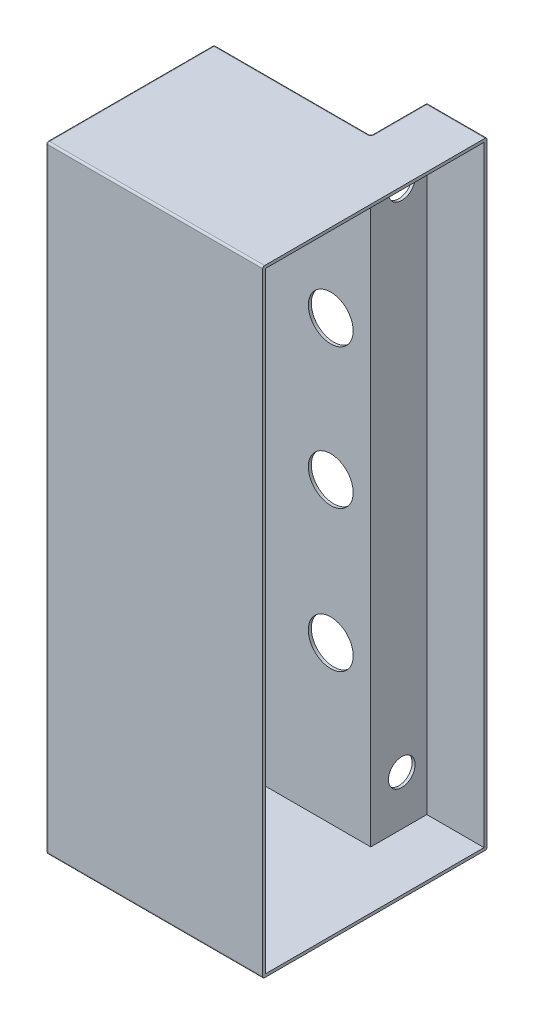
ISO-10303-21;
HEADER;
FILE_DESCRIPTION(('STEP AP214'),'2;1');
FILE_NAME('part.step','',(''),(''),'','','');
FILE_SCHEMA(('AUTOMOTIVE_DESIGN { 1 0 10303 214 1 1 1 1 }'));
ENDSEC;
DATA;
#1=APPLICATION_CONTEXT('core data for automotive mechanical design processes');
#2=APPLICATION_PROTOCOL_DEFINITION('international standard','automotive_design',2000,#1);
#3=PRODUCT_CONTEXT('',#1,'mechanical');
#4=PRODUCT('Part','Part','',(#3));
#5=PRODUCT_RELATED_PRODUCT_CATEGORY('part','',(#4));
#6=PRODUCT_DEFINITION_FORMATION('','',#4);
#7=PRODUCT_DEFINITION_CONTEXT('part definition',#1,'design');
#8=PRODUCT_DEFINITION('design','',#6,#7);
#9=PRODUCT_DEFINITION_SHAPE('','',#8);
#10=(LENGTH_UNIT() NAMED_UNIT(*) SI_UNIT(.MILLI.,.METRE.));
#11=(NAMED_UNIT(*) PLANE_ANGLE_UNIT() SI_UNIT($,.RADIAN.));
#12=(NAMED_UNIT(*) SI_UNIT($,.STERADIAN.) SOLID_ANGLE_UNIT());
#13=UNCERTAINTY_MEASURE_WITH_UNIT(LENGTH_MEASURE(1.E-05),#10,'distance_accuracy_value','');
#14=(GEOMETRIC_REPRESENTATION_CONTEXT(3) GLOBAL_UNCERTAINTY_ASSIGNED_CONTEXT((#13)) GLOBAL_UNIT_ASSIGNED_CONTEXT((#10,
#11,#12)) REPRESENTATION_CONTEXT('',''));
#15=CARTESIAN_POINT('',(0.,0.,0.));
#16=DIRECTION('',(0.,0.,1.));
#17=DIRECTION('',(1.,0.,0.));
#18=AXIS2_PLACEMENT_3D('',#15,#16,#17);
#19=CARTESIAN_POINT('',(3.,165.,-5.));
#20=DIRECTION('',(-1.,0.,0.));
#21=DIRECTION('',(0.,0.,1.));
#22=AXIS2_PLACEMENT_3D('',#19,#20,#21);
#23=PLANE('',#22);
#24=DIRECTION('',(0.,0.,-1.));
#25=VECTOR('',#24,1.);
#26=CARTESIAN_POINT('',(3.,0.,-5.));
#27=LINE('',#26,#25);
#28=CARTESIAN_POINT('',(3.,0.,54.5));
#29=VERTEX_POINT('',#28);
#30=CARTESIAN_POINT('',(3.,0.,-4.5));
#31=VERTEX_POINT('',#30);
#32=EDGE_CURVE('E250',#29,#31,#27,.T.);
#33=ORIENTED_EDGE('',*,*,#32,.T.);
#34=CARTESIAN_POINT('',(3.,0.5,-4.5));
#35=DIRECTION('',(-1.,0.,0.));
#36=DIRECTION('',(0.,0.,1.));
#37=AXIS2_PLACEMENT_3D('',#34,#35,#36);
#38=CIRCLE('',#37,0.5);
#39=CARTESIAN_POINT('',(3.,0.5,-5.));
#40=VERTEX_POINT('',#39);
#41=EDGE_CURVE('E294',#31,#40,#38,.F.);
#42=ORIENTED_EDGE('',*,*,#41,.T.);
#43=DIRECTION('',(0.,-1.,0.));
#44=VECTOR('',#43,1.);
#45=CARTESIAN_POINT('',(3.,165.,-5.));
#46=LINE('',#45,#44);
#47=CARTESIAN_POINT('',(3.,164.5,-5.));
#48=VERTEX_POINT('',#47);
#49=EDGE_CURVE('E249',#48,#40,#46,.T.);
#50=ORIENTED_EDGE('',*,*,#49,.F.);
#51=CARTESIAN_POINT('',(3.,164.5,-4.5));
#52=DIRECTION('',(-1.,0.,0.));
#53=DIRECTION('',(0.,0.,1.));
#54=AXIS2_PLACEMENT_3D('',#51,#52,#53);
#55=CIRCLE('',#54,0.5);
#56=CARTESIAN_POINT('',(3.,165.,-4.5));
#57=VERTEX_POINT('',#56);
#58=EDGE_CURVE('E290',#48,#57,#55,.F.);
#59=ORIENTED_EDGE('',*,*,#58,.T.);
#60=DIRECTION('',(0.,0.,-1.));
#61=VECTOR('',#60,1.);
#62=CARTESIAN_POINT('',(3.,165.,-5.));
#63=LINE('',#62,#61);
#64=CARTESIAN_POINT('',(3.,165.,54.5));
#65=VERTEX_POINT('',#64);
#66=EDGE_CURVE('E247',#65,#57,#63,.T.);
#67=ORIENTED_EDGE('',*,*,#66,.F.);
#68=CARTESIAN_POINT('',(3.,164.5,54.5));
#69=DIRECTION('',(-1.,0.,0.));
#70=DIRECTION('',(0.,0.,1.));
#71=AXIS2_PLACEMENT_3D('',#68,#69,#70);
#72=CIRCLE('',#71,0.5);
#73=CARTESIAN_POINT('',(3.,164.5,55.));
#74=VERTEX_POINT('',#73);
#75=EDGE_CURVE('E288',#65,#74,#72,.F.);
#76=ORIENTED_EDGE('',*,*,#75,.T.);
#77=DIRECTION('',(0.,-1.,0.));
#78=VECTOR('',#77,1.);
#79=CARTESIAN_POINT('',(3.,165.,55.));
#80=LINE('',#79,#78);
#81=CARTESIAN_POINT('',(3.,0.5,55.));
#82=VERTEX_POINT('',#81);
#83=EDGE_CURVE('E255',#74,#82,#80,.T.);
#84=ORIENTED_EDGE('',*,*,#83,.T.);
#85=CARTESIAN_POINT('',(3.,0.5,54.5));
#86=DIRECTION('',(-1.,0.,0.));
#87=DIRECTION('',(0.,0.,1.));
#88=AXIS2_PLACEMENT_3D('',#85,#86,#87);
#89=CIRCLE('',#88,0.5);
#90=EDGE_CURVE('E292',#82,#29,#89,.F.);
#91=ORIENTED_EDGE('',*,*,#90,.T.);
#92=EDGE_LOOP('',(#33,#42,#50,#59,#67,#76,#84,#91));
#93=FACE_BOUND('',#92,.T.);
#94=DIRECTION('',(0.,0.,-1.));
#95=VECTOR('',#94,1.);
#96=CARTESIAN_POINT('',(3.,0.8,0.));
#97=LINE('',#96,#95);
#98=CARTESIAN_POINT('',(3.,0.8,54.2));
#99=VERTEX_POINT('',#98);
#100=CARTESIAN_POINT('',(3.,0.8,-4.2));
#101=VERTEX_POINT('',#100);
#102=EDGE_CURVE('E234',#99,#101,#97,.T.);
#103=ORIENTED_EDGE('',*,*,#102,.F.);
#104=DIRECTION('',(0.,-1.,0.));
#105=VECTOR('',#104,1.);
#106=CARTESIAN_POINT('',(3.,165.,54.2));
#107=LINE('',#106,#105);
#108=CARTESIAN_POINT('',(3.,164.2,54.2));
#109=VERTEX_POINT('',#108);
#110=EDGE_CURVE('E230',#109,#99,#107,.T.);
#111=ORIENTED_EDGE('',*,*,#110,.F.);
#112=DIRECTION('',(0.,0.,-1.));
#113=VECTOR('',#112,1.);
#114=CARTESIAN_POINT('',(3.,164.2,0.));
#115=LINE('',#114,#113);
#116=CARTESIAN_POINT('',(3.,164.2,-4.2));
#117=VERTEX_POINT('',#116);
#118=EDGE_CURVE('E237',#109,#117,#115,.T.);
#119=ORIENTED_EDGE('',*,*,#118,.T.);
#120=DIRECTION('',(0.,-1.,0.));
#121=VECTOR('',#120,1.);
#122=CARTESIAN_POINT('',(3.,165.,-4.2));
#123=LINE('',#122,#121);
#124=EDGE_CURVE('E238',#117,#101,#123,.T.);
#125=ORIENTED_EDGE('',*,*,#124,.T.);
#126=EDGE_LOOP('',(#103,#111,#119,#125));
#127=FACE_BOUND('',#126,.T.);
#128=ADVANCED_FACE('F41',(#93,#127),#23,.F.);
#129=CARTESIAN_POINT('',(-13.1,165.,-5.));
#130=DIRECTION('',(0.,0.,1.));
#131=DIRECTION('',(1.,0.,0.));
#132=AXIS2_PLACEMENT_3D('',#129,#130,#131);
#133=PLANE('',#132);
#134=ORIENTED_EDGE('',*,*,#49,.T.);
#135=DIRECTION('',(-1.,0.,0.));
#136=VECTOR('',#135,1.);
#137=CARTESIAN_POINT('',(-13.1,0.5,-5.));
#138=LINE('',#137,#136);
#139=CARTESIAN_POINT('',(-12.6,0.5,-5.));
#140=VERTEX_POINT('',#139);
#141=EDGE_CURVE('E272',#40,#140,#138,.T.);
#142=ORIENTED_EDGE('',*,*,#141,.T.);
#143=DIRECTION('',(0.,-1.,0.));
#144=VECTOR('',#143,1.);
#145=CARTESIAN_POINT('',(-12.6,165.,-5.));
#146=LINE('',#145,#144);
#147=CARTESIAN_POINT('',(-12.6,164.5,-5.));
#148=VERTEX_POINT('',#147);
#149=EDGE_CURVE('E270',#140,#148,#146,.F.);
#150=ORIENTED_EDGE('',*,*,#149,.T.);
#151=DIRECTION('',(-1.,0.,0.));
#152=VECTOR('',#151,1.);
#153=CARTESIAN_POINT('',(-13.1,164.5,-5.));
#154=LINE('',#153,#152);
#155=EDGE_CURVE('E258',#148,#48,#154,.F.);
#156=ORIENTED_EDGE('',*,*,#155,.T.);
#157=EDGE_LOOP('',(#134,#142,#150,#156));
#158=FACE_BOUND('',#157,.T.);
#159=ADVANCED_FACE('F455',(#158),#133,.F.);
#160=CARTESIAN_POINT('',(-13.1,165.,10.));
#161=DIRECTION('',(1.,0.,0.));
#162=DIRECTION('',(0.,0.,-1.));
#163=AXIS2_PLACEMENT_3D('',#160,#161,#162);
#164=PLANE('',#163);
#165=CARTESIAN_POINT('',(-13.1,150.,2.5));
#166=DIRECTION('',(-1.,0.,0.));
#167=DIRECTION('',(0.,0.,1.));
#168=AXIS2_PLACEMENT_3D('',#165,#166,#167);
#169=CIRCLE('',#168,3.57187499999997);
#170=CARTESIAN_POINT('',(-13.1,150.,6.07187499999997));
#171=VERTEX_POINT('',#170);
#172=EDGE_CURVE('E416',#171,#171,#169,.T.);
#173=ORIENTED_EDGE('',*,*,#172,.F.);
#174=EDGE_LOOP('',(#173));
#175=FACE_BOUND('',#174,.T.);
#176=CARTESIAN_POINT('',(-13.1,14.,2.5));
#177=DIRECTION('',(-1.,0.,0.));
#178=DIRECTION('',(0.,0.,1.));
#179=AXIS2_PLACEMENT_3D('',#176,#177,#178);
#180=CIRCLE('',#179,3.57187499999999);
#181=CARTESIAN_POINT('',(-13.1,14.,6.07187499999999));
#182=VERTEX_POINT('',#181);
#183=EDGE_CURVE('E408',#182,#182,#180,.T.);
#184=ORIENTED_EDGE('',*,*,#183,.F.);
#185=EDGE_LOOP('',(#184));
#186=FACE_BOUND('',#185,.T.);
#187=DIRECTION('',(0.,-1.,0.));
#188=VECTOR('',#187,1.);
#189=CARTESIAN_POINT('',(-13.1,165.,-4.5));
#190=LINE('',#189,#188);
#191=CARTESIAN_POINT('',(-13.1,164.5,-4.5));
#192=VERTEX_POINT('',#191);
#193=CARTESIAN_POINT('',(-13.1,0.5,-4.5));
#194=VERTEX_POINT('',#193);
#195=EDGE_CURVE('E298',#192,#194,#190,.T.);
#196=ORIENTED_EDGE('',*,*,#195,.T.);
#197=DIRECTION('',(0.,0.,1.));
#198=VECTOR('',#197,1.);
#199=CARTESIAN_POINT('',(-13.1,0.5,10.));
#200=LINE('',#199,#198);
#201=CARTESIAN_POINT('',(-13.1,0.5,9.5));
#202=VERTEX_POINT('',#201);
#203=EDGE_CURVE('E302',#194,#202,#200,.T.);
#204=ORIENTED_EDGE('',*,*,#203,.T.);
#205=DIRECTION('',(0.,-1.,0.));
#206=VECTOR('',#205,1.);
#207=CARTESIAN_POINT('',(-13.1,165.,9.5));
#208=LINE('',#207,#206);
#209=CARTESIAN_POINT('',(-13.1,164.5,9.5));
#210=VERTEX_POINT('',#209);
#211=EDGE_CURVE('E300',#202,#210,#208,.F.);
#212=ORIENTED_EDGE('',*,*,#211,.T.);
#213=DIRECTION('',(0.,0.,1.));
#214=VECTOR('',#213,1.);
#215=CARTESIAN_POINT('',(-13.1,164.5,10.));
#216=LINE('',#215,#214);
#217=EDGE_CURVE('E296',#210,#192,#216,.F.);
#218=ORIENTED_EDGE('',*,*,#217,.T.);
#219=EDGE_LOOP('',(#196,#204,#212,#218));
#220=FACE_BOUND('',#219,.T.);
#221=ADVANCED_FACE('F461',(#175,#186,#220),#164,.F.);
#222=CARTESIAN_POINT('',(-55.,165.,10.));
#223=DIRECTION('',(0.,0.,1.));
#224=DIRECTION('',(1.,0.,0.));
#225=AXIS2_PLACEMENT_3D('',#222,#223,#224);
#226=PLANE('',#225);
#227=DIRECTION('',(-1.,0.,0.));
#228=VECTOR('',#227,1.);
#229=CARTESIAN_POINT('',(-55.,164.5,10.));
#230=LINE('',#229,#228);
#231=CARTESIAN_POINT('',(-54.5,164.5,10.));
#232=VERTEX_POINT('',#231);
#233=CARTESIAN_POINT('',(-13.6,164.5,10.));
#234=VERTEX_POINT('',#233);
#235=EDGE_CURVE('E305',#232,#234,#230,.F.);
#236=ORIENTED_EDGE('',*,*,#235,.T.);
#237=DIRECTION('',(0.,-1.,0.));
#238=VECTOR('',#237,1.);
#239=CARTESIAN_POINT('',(-13.6,0.,10.));
#240=LINE('',#239,#238);
#241=CARTESIAN_POINT('',(-13.6,0.5,10.));
#242=VERTEX_POINT('',#241);
#243=EDGE_CURVE('E311',#234,#242,#240,.T.);
#244=ORIENTED_EDGE('',*,*,#243,.T.);
#245=DIRECTION('',(-1.,0.,0.));
#246=VECTOR('',#245,1.);
#247=CARTESIAN_POINT('',(-55.,0.5,10.));
#248=LINE('',#247,#246);
#249=CARTESIAN_POINT('',(-54.5,0.5,10.));
#250=VERTEX_POINT('',#249);
#251=EDGE_CURVE('E309',#242,#250,#248,.T.);
#252=ORIENTED_EDGE('',*,*,#251,.T.);
#253=DIRECTION('',(0.,-1.,0.));
#254=VECTOR('',#253,1.);
#255=CARTESIAN_POINT('',(-54.5,165.,10.));
#256=LINE('',#255,#254);
#257=EDGE_CURVE('E307',#250,#232,#256,.F.);
#258=ORIENTED_EDGE('',*,*,#257,.T.);
#259=EDGE_LOOP('',(#236,#244,#252,#258));
#260=FACE_BOUND('',#259,.T.);
#261=CARTESIAN_POINT('',(-23.,42.75,10.));
#262=DIRECTION('',(0.,0.,-1.));
#263=DIRECTION('',(-1.,0.,0.));
#264=AXIS2_PLACEMENT_3D('',#261,#262,#263);
#265=CIRCLE('',#264,6.);
#266=CARTESIAN_POINT('',(-29.,42.75,10.));
#267=VERTEX_POINT('',#266);
#268=EDGE_CURVE('E263',#267,#267,#265,.T.);
#269=ORIENTED_EDGE('',*,*,#268,.F.);
#270=EDGE_LOOP('',(#269));
#271=FACE_BOUND('',#270,.T.);
#272=CARTESIAN_POINT('',(-23.,80.55,10.));
#273=DIRECTION('',(0.,0.,-1.));
#274=DIRECTION('',(-1.,0.,0.));
#275=AXIS2_PLACEMENT_3D('',#272,#273,#274);
#276=CIRCLE('',#275,6.);
#277=CARTESIAN_POINT('',(-29.,80.55,10.));
#278=VERTEX_POINT('',#277);
#279=EDGE_CURVE('E421',#278,#278,#276,.T.);
#280=ORIENTED_EDGE('',*,*,#279,.F.);
#281=EDGE_LOOP('',(#280));
#282=FACE_BOUND('',#281,.T.);
#283=CARTESIAN_POINT('',(-23.,118.,10.));
#284=DIRECTION('',(0.,0.,-1.));
#285=DIRECTION('',(-1.,0.,0.));
#286=AXIS2_PLACEMENT_3D('',#283,#284,#285);
#287=CIRCLE('',#286,6.);
#288=CARTESIAN_POINT('',(-29.,118.,10.));
#289=VERTEX_POINT('',#288);
#290=EDGE_CURVE('E406',#289,#289,#287,.T.);
#291=ORIENTED_EDGE('',*,*,#290,.F.);
#292=EDGE_LOOP('',(#291));
#293=FACE_BOUND('',#292,.T.);
#294=ADVANCED_FACE('F476',(#260,#271,#282,#293),#226,.F.);
#295=CARTESIAN_POINT('',(-55.,165.,55.));
#296=DIRECTION('',(1.,0.,0.));
#297=DIRECTION('',(0.,0.,-1.));
#298=AXIS2_PLACEMENT_3D('',#295,#296,#297);
#299=PLANE('',#298);
#300=DIRECTION('',(0.,-1.,0.));
#301=VECTOR('',#300,1.);
#302=CARTESIAN_POINT('',(-55.,165.,10.5));
#303=LINE('',#302,#301);
#304=CARTESIAN_POINT('',(-55.,164.5,10.5));
#305=VERTEX_POINT('',#304);
#306=CARTESIAN_POINT('',(-55.,0.5,10.5));
#307=VERTEX_POINT('',#306);
#308=EDGE_CURVE('E324',#305,#307,#303,.T.);
#309=ORIENTED_EDGE('',*,*,#308,.T.);
#310=DIRECTION('',(0.,0.,1.));
#311=VECTOR('',#310,1.);
#312=CARTESIAN_POINT('',(-55.,0.5,55.));
#313=LINE('',#312,#311);
#314=CARTESIAN_POINT('',(-55.,0.5,54.5));
#315=VERTEX_POINT('',#314);
#316=EDGE_CURVE('E326',#307,#315,#313,.T.);
#317=ORIENTED_EDGE('',*,*,#316,.T.);
#318=DIRECTION('',(0.,-1.,0.));
#319=VECTOR('',#318,1.);
#320=CARTESIAN_POINT('',(-55.,165.,54.5));
#321=LINE('',#320,#319);
#322=CARTESIAN_POINT('',(-55.,164.5,54.5));
#323=VERTEX_POINT('',#322);
#324=EDGE_CURVE('E320',#315,#323,#321,.F.);
#325=ORIENTED_EDGE('',*,*,#324,.T.);
#326=DIRECTION('',(0.,0.,1.));
#327=VECTOR('',#326,1.);
#328=CARTESIAN_POINT('',(-55.,164.5,55.));
#329=LINE('',#328,#327);
#330=EDGE_CURVE('E322',#323,#305,#329,.F.);
#331=ORIENTED_EDGE('',*,*,#330,.T.);
#332=EDGE_LOOP('',(#309,#317,#325,#331));
#333=FACE_BOUND('',#332,.T.);
#334=ADVANCED_FACE('F472',(#333),#299,.F.);
#335=CARTESIAN_POINT('',(3.,165.,55.));
#336=DIRECTION('',(0.,0.,-1.));
#337=DIRECTION('',(-1.,0.,0.));
#338=AXIS2_PLACEMENT_3D('',#335,#336,#337);
#339=PLANE('',#338);
#340=DIRECTION('',(0.,-1.,0.));
#341=VECTOR('',#340,1.);
#342=CARTESIAN_POINT('',(-54.5,165.,55.));
#343=LINE('',#342,#341);
#344=CARTESIAN_POINT('',(-54.5,164.5,55.));
#345=VERTEX_POINT('',#344);
#346=CARTESIAN_POINT('',(-54.5,0.5,55.));
#347=VERTEX_POINT('',#346);
#348=EDGE_CURVE('E314',#345,#347,#343,.T.);
#349=ORIENTED_EDGE('',*,*,#348,.T.);
#350=DIRECTION('',(1.,0.,0.));
#351=VECTOR('',#350,1.);
#352=CARTESIAN_POINT('',(3.,0.5,55.));
#353=LINE('',#352,#351);
#354=EDGE_CURVE('E318',#347,#82,#353,.T.);
#355=ORIENTED_EDGE('',*,*,#354,.T.);
#356=ORIENTED_EDGE('',*,*,#83,.F.);
#357=DIRECTION('',(1.,0.,0.));
#358=VECTOR('',#357,1.);
#359=CARTESIAN_POINT('',(3.,164.5,55.));
#360=LINE('',#359,#358);
#361=EDGE_CURVE('E316',#74,#345,#360,.F.);
#362=ORIENTED_EDGE('',*,*,#361,.T.);
#363=EDGE_LOOP('',(#349,#355,#356,#362));
#364=FACE_BOUND('',#363,.T.);
#365=ADVANCED_FACE('F468',(#364),#339,.F.);
#366=CARTESIAN_POINT('',(0.,165.,0.));
#367=DIRECTION('',(0.,-1.,0.));
#368=DIRECTION('',(0.,0.,-1.));
#369=AXIS2_PLACEMENT_3D('',#366,#367,#368);
#370=PLANE('',#369);
#371=ORIENTED_EDGE('',*,*,#66,.T.);
#372=DIRECTION('',(-1.,0.,0.));
#373=VECTOR('',#372,1.);
#374=CARTESIAN_POINT('',(0.,165.,-4.5));
#375=LINE('',#374,#373);
#376=CARTESIAN_POINT('',(-12.6,165.,-4.5));
#377=VERTEX_POINT('',#376);
#378=EDGE_CURVE('E11',#57,#377,#375,.T.);
#379=ORIENTED_EDGE('',*,*,#378,.T.);
#380=DIRECTION('',(0.,0.,1.));
#381=VECTOR('',#380,1.);
#382=CARTESIAN_POINT('',(-12.6,165.,0.));
#383=LINE('',#382,#381);
#384=CARTESIAN_POINT('',(-12.6,165.,9.5));
#385=VERTEX_POINT('',#384);
#386=EDGE_CURVE('E50',#377,#385,#383,.T.);
#387=ORIENTED_EDGE('',*,*,#386,.T.);
#388=CARTESIAN_POINT('',(-13.6,165.,9.5));
#389=DIRECTION('',(0.,-1.,0.));
#390=DIRECTION('',(0.,0.,-1.));
#391=AXIS2_PLACEMENT_3D('',#388,#389,#390);
#392=CIRCLE('',#391,1.);
#393=CARTESIAN_POINT('',(-13.6,165.,10.5));
#394=VERTEX_POINT('',#393);
#395=EDGE_CURVE('E335',#394,#385,#392,.F.);
#396=ORIENTED_EDGE('',*,*,#395,.F.);
#397=DIRECTION('',(-1.,0.,0.));
#398=VECTOR('',#397,1.);
#399=CARTESIAN_POINT('',(0.,165.,10.5));
#400=LINE('',#399,#398);
#401=CARTESIAN_POINT('',(-54.5,165.,10.5));
#402=VERTEX_POINT('',#401);
#403=EDGE_CURVE('E333',#394,#402,#400,.T.);
#404=ORIENTED_EDGE('',*,*,#403,.T.);
#405=DIRECTION('',(0.,0.,1.));
#406=VECTOR('',#405,1.);
#407=CARTESIAN_POINT('',(-54.5,165.,0.));
#408=LINE('',#407,#406);
#409=CARTESIAN_POINT('',(-54.5,165.,54.5));
#410=VERTEX_POINT('',#409);
#411=EDGE_CURVE('E331',#402,#410,#408,.T.);
#412=ORIENTED_EDGE('',*,*,#411,.T.);
#413=DIRECTION('',(1.,0.,0.));
#414=VECTOR('',#413,1.);
#415=CARTESIAN_POINT('',(0.,165.,54.5));
#416=LINE('',#415,#414);
#417=EDGE_CURVE('E329',#410,#65,#416,.T.);
#418=ORIENTED_EDGE('',*,*,#417,.T.);
#419=EDGE_LOOP('',(#371,#379,#387,#396,#404,#412,#418));
#420=FACE_BOUND('',#419,.T.);
#421=ADVANCED_FACE('F471',(#420),#370,.F.);
#422=CARTESIAN_POINT('',(0.,0.,0.));
#423=DIRECTION('',(0.,-1.,0.));
#424=DIRECTION('',(0.,0.,-1.));
#425=AXIS2_PLACEMENT_3D('',#422,#423,#424);
#426=PLANE('',#425);
#427=DIRECTION('',(0.,0.,1.));
#428=VECTOR('',#427,1.);
#429=CARTESIAN_POINT('',(-12.6,0.,-5.));
#430=LINE('',#429,#428);
#431=CARTESIAN_POINT('',(-12.6,0.,9.5));
#432=VERTEX_POINT('',#431);
#433=CARTESIAN_POINT('',(-12.6,0.,-4.5));
#434=VERTEX_POINT('',#433);
#435=EDGE_CURVE('E284',#432,#434,#430,.F.);
#436=ORIENTED_EDGE('',*,*,#435,.T.);
#437=DIRECTION('',(-1.,0.,0.));
#438=VECTOR('',#437,1.);
#439=CARTESIAN_POINT('',(3.,0.,-4.5));
#440=LINE('',#439,#438);
#441=EDGE_CURVE('E286',#434,#31,#440,.F.);
#442=ORIENTED_EDGE('',*,*,#441,.T.);
#443=ORIENTED_EDGE('',*,*,#32,.F.);
#444=DIRECTION('',(1.,0.,0.));
#445=VECTOR('',#444,1.);
#446=CARTESIAN_POINT('',(-55.,0.,54.5));
#447=LINE('',#446,#445);
#448=CARTESIAN_POINT('',(-54.5,0.,54.5));
#449=VERTEX_POINT('',#448);
#450=EDGE_CURVE('E279',#29,#449,#447,.F.);
#451=ORIENTED_EDGE('',*,*,#450,.T.);
#452=DIRECTION('',(0.,0.,1.));
#453=VECTOR('',#452,1.);
#454=CARTESIAN_POINT('',(-54.5,0.,10.));
#455=LINE('',#454,#453);
#456=CARTESIAN_POINT('',(-54.5,0.,10.5));
#457=VERTEX_POINT('',#456);
#458=EDGE_CURVE('E275',#449,#457,#455,.F.);
#459=ORIENTED_EDGE('',*,*,#458,.T.);
#460=DIRECTION('',(-1.,0.,0.));
#461=VECTOR('',#460,1.);
#462=CARTESIAN_POINT('',(-13.1,0.,10.5));
#463=LINE('',#462,#461);
#464=CARTESIAN_POINT('',(-13.6,0.,10.5));
#465=VERTEX_POINT('',#464);
#466=EDGE_CURVE('E277',#457,#465,#463,.F.);
#467=ORIENTED_EDGE('',*,*,#466,.T.);
#468=CARTESIAN_POINT('',(-13.6,0.,9.5));
#469=DIRECTION('',(0.,-1.,0.));
#470=DIRECTION('',(0.,0.,-1.));
#471=AXIS2_PLACEMENT_3D('',#468,#469,#470);
#472=CIRCLE('',#471,1.);
#473=EDGE_CURVE('E281',#432,#465,#472,.T.);
#474=ORIENTED_EDGE('',*,*,#473,.F.);
#475=EDGE_LOOP('',(#436,#442,#443,#451,#459,#467,#474));
#476=FACE_BOUND('',#475,.T.);
#477=ADVANCED_FACE('F466',(#476),#426,.T.);
#478=CARTESIAN_POINT('',(-13.1,165.,-4.2));
#479=DIRECTION('',(0.,0.,1.));
#480=DIRECTION('',(1.,0.,0.));
#481=AXIS2_PLACEMENT_3D('',#478,#479,#480);
#482=PLANE('',#481);
#483=DIRECTION('',(-1.,0.,0.));
#484=VECTOR('',#483,1.);
#485=CARTESIAN_POINT('',(0.,0.8,-4.2));
#486=LINE('',#485,#484);
#487=CARTESIAN_POINT('',(-12.3,0.8,-4.2));
#488=VERTEX_POINT('',#487);
#489=EDGE_CURVE('E200',#101,#488,#486,.T.);
#490=ORIENTED_EDGE('',*,*,#489,.F.);
#491=ORIENTED_EDGE('',*,*,#124,.F.);
#492=DIRECTION('',(-1.,0.,0.));
#493=VECTOR('',#492,1.);
#494=CARTESIAN_POINT('',(0.,164.2,-4.2));
#495=LINE('',#494,#493);
#496=CARTESIAN_POINT('',(-12.3,164.2,-4.2));
#497=VERTEX_POINT('',#496);
#498=EDGE_CURVE('E246',#117,#497,#495,.T.);
#499=ORIENTED_EDGE('',*,*,#498,.T.);
#500=DIRECTION('',(0.,-1.,0.));
#501=VECTOR('',#500,1.);
#502=CARTESIAN_POINT('',(-12.3,165.,-4.2));
#503=LINE('',#502,#501);
#504=EDGE_CURVE('E211',#497,#488,#503,.T.);
#505=ORIENTED_EDGE('',*,*,#504,.T.);
#506=EDGE_LOOP('',(#490,#491,#499,#505));
#507=FACE_BOUND('',#506,.T.);
#508=ADVANCED_FACE('F431',(#507),#482,.T.);
#509=CARTESIAN_POINT('',(-12.3,165.,10.));
#510=DIRECTION('',(1.,0.,0.));
#511=DIRECTION('',(0.,0.,-1.));
#512=AXIS2_PLACEMENT_3D('',#509,#510,#511);
#513=PLANE('',#512);
#514=CARTESIAN_POINT('',(-12.3,150.,2.5));
#515=DIRECTION('',(1.,0.,0.));
#516=DIRECTION('',(0.,0.,-1.));
#517=AXIS2_PLACEMENT_3D('',#514,#515,#516);
#518=CIRCLE('',#517,3.57187499999999);
#519=CARTESIAN_POINT('',(-12.3,150.,-1.07187499999999));
#520=VERTEX_POINT('',#519);
#521=EDGE_CURVE('E45',#520,#520,#518,.T.);
#522=ORIENTED_EDGE('',*,*,#521,.F.);
#523=EDGE_LOOP('',(#522));
#524=FACE_BOUND('',#523,.T.);
#525=CARTESIAN_POINT('',(-12.3,14.,2.5));
#526=DIRECTION('',(1.,0.,0.));
#527=DIRECTION('',(0.,0.,-1.));
#528=AXIS2_PLACEMENT_3D('',#525,#526,#527);
#529=CIRCLE('',#528,3.57187499999999);
#530=CARTESIAN_POINT('',(-12.3,14.,-1.07187499999999));
#531=VERTEX_POINT('',#530);
#532=EDGE_CURVE('E341',#531,#531,#529,.T.);
#533=ORIENTED_EDGE('',*,*,#532,.F.);
#534=EDGE_LOOP('',(#533));
#535=FACE_BOUND('',#534,.T.);
#536=DIRECTION('',(0.,0.,1.));
#537=VECTOR('',#536,1.);
#538=CARTESIAN_POINT('',(-12.3,0.8,0.));
#539=LINE('',#538,#537);
#540=CARTESIAN_POINT('',(-12.3,0.8,10.8));
#541=VERTEX_POINT('',#540);
#542=EDGE_CURVE('E193',#488,#541,#539,.T.);
#543=ORIENTED_EDGE('',*,*,#542,.F.);
#544=ORIENTED_EDGE('',*,*,#504,.F.);
#545=DIRECTION('',(0.,0.,1.));
#546=VECTOR('',#545,1.);
#547=CARTESIAN_POINT('',(-12.3,164.2,0.));
#548=LINE('',#547,#546);
#549=CARTESIAN_POINT('',(-12.3,164.2,10.8));
#550=VERTEX_POINT('',#549);
#551=EDGE_CURVE('E208',#497,#550,#548,.T.);
#552=ORIENTED_EDGE('',*,*,#551,.T.);
#553=DIRECTION('',(0.,-1.,0.));
#554=VECTOR('',#553,1.);
#555=CARTESIAN_POINT('',(-12.3,165.,10.8));
#556=LINE('',#555,#554);
#557=EDGE_CURVE('E206',#550,#541,#556,.T.);
#558=ORIENTED_EDGE('',*,*,#557,.T.);
#559=EDGE_LOOP('',(#543,#544,#552,#558));
#560=FACE_BOUND('',#559,.T.);
#561=ADVANCED_FACE('F207',(#524,#535,#560),#513,.T.);
#562=CARTESIAN_POINT('',(-55.,165.,10.8));
#563=DIRECTION('',(0.,0.,1.));
#564=DIRECTION('',(1.,0.,0.));
#565=AXIS2_PLACEMENT_3D('',#562,#563,#564);
#566=PLANE('',#565);
#567=CARTESIAN_POINT('',(-23.,42.75,10.8));
#568=DIRECTION('',(0.,0.,1.));
#569=DIRECTION('',(1.,0.,0.));
#570=AXIS2_PLACEMENT_3D('',#567,#568,#569);
#571=CIRCLE('',#570,6.);
#572=CARTESIAN_POINT('',(-17.,42.75,10.8));
#573=VERTEX_POINT('',#572);
#574=EDGE_CURVE('E266',#573,#573,#571,.T.);
#575=ORIENTED_EDGE('',*,*,#574,.F.);
#576=EDGE_LOOP('',(#575));
#577=FACE_BOUND('',#576,.T.);
#578=CARTESIAN_POINT('',(-23.,80.55,10.8));
#579=DIRECTION('',(0.,0.,1.));
#580=DIRECTION('',(1.,0.,0.));
#581=AXIS2_PLACEMENT_3D('',#578,#579,#580);
#582=CIRCLE('',#581,6.);
#583=CARTESIAN_POINT('',(-17.,80.55,10.8));
#584=VERTEX_POINT('',#583);
#585=EDGE_CURVE('E262',#584,#584,#582,.T.);
#586=ORIENTED_EDGE('',*,*,#585,.F.);
#587=EDGE_LOOP('',(#586));
#588=FACE_BOUND('',#587,.T.);
#589=CARTESIAN_POINT('',(-23.,118.,10.8));
#590=DIRECTION('',(0.,0.,1.));
#591=DIRECTION('',(1.,0.,0.));
#592=AXIS2_PLACEMENT_3D('',#589,#590,#591);
#593=CIRCLE('',#592,6.);
#594=CARTESIAN_POINT('',(-17.,118.,10.8));
#595=VERTEX_POINT('',#594);
#596=EDGE_CURVE('E259',#595,#595,#593,.T.);
#597=ORIENTED_EDGE('',*,*,#596,.F.);
#598=EDGE_LOOP('',(#597));
#599=FACE_BOUND('',#598,.T.);
#600=DIRECTION('',(-1.,0.,0.));
#601=VECTOR('',#600,1.);
#602=CARTESIAN_POINT('',(0.,0.8,10.8));
#603=LINE('',#602,#601);
#604=CARTESIAN_POINT('',(-54.2,0.8,10.8));
#605=VERTEX_POINT('',#604);
#606=EDGE_CURVE('E197',#541,#605,#603,.T.);
#607=ORIENTED_EDGE('',*,*,#606,.F.);
#608=ORIENTED_EDGE('',*,*,#557,.F.);
#609=DIRECTION('',(-1.,0.,0.));
#610=VECTOR('',#609,1.);
#611=CARTESIAN_POINT('',(0.,164.2,10.8));
#612=LINE('',#611,#610);
#613=CARTESIAN_POINT('',(-54.2,164.2,10.8));
#614=VERTEX_POINT('',#613);
#615=EDGE_CURVE('E225',#550,#614,#612,.T.);
#616=ORIENTED_EDGE('',*,*,#615,.T.);
#617=DIRECTION('',(0.,-1.,0.));
#618=VECTOR('',#617,1.);
#619=CARTESIAN_POINT('',(-54.2,165.,10.8));
#620=LINE('',#619,#618);
#621=EDGE_CURVE('E212',#614,#605,#620,.T.);
#622=ORIENTED_EDGE('',*,*,#621,.T.);
#623=EDGE_LOOP('',(#607,#608,#616,#622));
#624=FACE_BOUND('',#623,.T.);
#625=ADVANCED_FACE('F214',(#577,#588,#599,#624),#566,.T.);
#626=CARTESIAN_POINT('',(-54.2,165.,55.));
#627=DIRECTION('',(1.,0.,0.));
#628=DIRECTION('',(0.,0.,-1.));
#629=AXIS2_PLACEMENT_3D('',#626,#627,#628);
#630=PLANE('',#629);
#631=DIRECTION('',(0.,0.,1.));
#632=VECTOR('',#631,1.);
#633=CARTESIAN_POINT('',(-54.2,0.8,0.));
#634=LINE('',#633,#632);
#635=CARTESIAN_POINT('',(-54.2,0.8,54.2));
#636=VERTEX_POINT('',#635);
#637=EDGE_CURVE('E217',#605,#636,#634,.T.);
#638=ORIENTED_EDGE('',*,*,#637,.F.);
#639=ORIENTED_EDGE('',*,*,#621,.F.);
#640=DIRECTION('',(0.,0.,1.));
#641=VECTOR('',#640,1.);
#642=CARTESIAN_POINT('',(-54.2,164.2,0.));
#643=LINE('',#642,#641);
#644=CARTESIAN_POINT('',(-54.2,164.2,54.2));
#645=VERTEX_POINT('',#644);
#646=EDGE_CURVE('E226',#614,#645,#643,.T.);
#647=ORIENTED_EDGE('',*,*,#646,.T.);
#648=DIRECTION('',(0.,-1.,0.));
#649=VECTOR('',#648,1.);
#650=CARTESIAN_POINT('',(-54.2,165.,54.2));
#651=LINE('',#650,#649);
#652=EDGE_CURVE('E224',#645,#636,#651,.T.);
#653=ORIENTED_EDGE('',*,*,#652,.T.);
#654=EDGE_LOOP('',(#638,#639,#647,#653));
#655=FACE_BOUND('',#654,.T.);
#656=ADVANCED_FACE('F444',(#655),#630,.T.);
#657=CARTESIAN_POINT('',(3.,165.,54.2));
#658=DIRECTION('',(0.,0.,-1.));
#659=DIRECTION('',(-1.,0.,0.));
#660=AXIS2_PLACEMENT_3D('',#657,#658,#659);
#661=PLANE('',#660);
#662=DIRECTION('',(1.,0.,0.));
#663=VECTOR('',#662,1.);
#664=CARTESIAN_POINT('',(0.,0.8,54.2));
#665=LINE('',#664,#663);
#666=EDGE_CURVE('E219',#636,#99,#665,.T.);
#667=ORIENTED_EDGE('',*,*,#666,.F.);
#668=ORIENTED_EDGE('',*,*,#652,.F.);
#669=DIRECTION('',(1.,0.,0.));
#670=VECTOR('',#669,1.);
#671=CARTESIAN_POINT('',(0.,164.2,54.2));
#672=LINE('',#671,#670);
#673=EDGE_CURVE('E232',#645,#109,#672,.T.);
#674=ORIENTED_EDGE('',*,*,#673,.T.);
#675=ORIENTED_EDGE('',*,*,#110,.T.);
#676=EDGE_LOOP('',(#667,#668,#674,#675));
#677=FACE_BOUND('',#676,.T.);
#678=ADVANCED_FACE('F440',(#677),#661,.T.);
#679=CARTESIAN_POINT('',(0.,164.2,0.));
#680=DIRECTION('',(0.,-1.,0.));
#681=DIRECTION('',(0.,0.,-1.));
#682=AXIS2_PLACEMENT_3D('',#679,#680,#681);
#683=PLANE('',#682);
#684=ORIENTED_EDGE('',*,*,#498,.F.);
#685=ORIENTED_EDGE('',*,*,#118,.F.);
#686=ORIENTED_EDGE('',*,*,#673,.F.);
#687=ORIENTED_EDGE('',*,*,#646,.F.);
#688=ORIENTED_EDGE('',*,*,#615,.F.);
#689=ORIENTED_EDGE('',*,*,#551,.F.);
#690=EDGE_LOOP('',(#684,#685,#686,#687,#688,#689));
#691=FACE_BOUND('',#690,.T.);
#692=ADVANCED_FACE('F433',(#691),#683,.T.);
#693=CARTESIAN_POINT('',(0.,0.8,0.));
#694=DIRECTION('',(0.,-1.,0.));
#695=DIRECTION('',(0.,0.,-1.));
#696=AXIS2_PLACEMENT_3D('',#693,#694,#695);
#697=PLANE('',#696);
#698=ORIENTED_EDGE('',*,*,#489,.T.);
#699=ORIENTED_EDGE('',*,*,#542,.T.);
#700=ORIENTED_EDGE('',*,*,#606,.T.);
#701=ORIENTED_EDGE('',*,*,#637,.T.);
#702=ORIENTED_EDGE('',*,*,#666,.T.);
#703=ORIENTED_EDGE('',*,*,#102,.T.);
#704=EDGE_LOOP('',(#698,#699,#700,#701,#702,#703));
#705=FACE_BOUND('',#704,.T.);
#706=ADVANCED_FACE('F195',(#705),#697,.F.);
#707=CARTESIAN_POINT('',(-23.,118.,11.));
#708=DIRECTION('',(0.,0.,-1.));
#709=DIRECTION('',(-1.,0.,0.));
#710=AXIS2_PLACEMENT_3D('',#707,#708,#709);
#711=CYLINDRICAL_SURFACE('',#710,6.);
#712=ORIENTED_EDGE('',*,*,#596,.T.);
#713=EDGE_LOOP('',(#712));
#714=FACE_BOUND('',#713,.T.);
#715=ORIENTED_EDGE('',*,*,#290,.T.);
#716=EDGE_LOOP('',(#715));
#717=FACE_BOUND('',#716,.T.);
#718=ADVANCED_FACE('F639',(#714,#717),#711,.F.);
#719=CARTESIAN_POINT('',(-23.,80.55,11.));
#720=DIRECTION('',(0.,0.,-1.));
#721=DIRECTION('',(-1.,0.,0.));
#722=AXIS2_PLACEMENT_3D('',#719,#720,#721);
#723=CYLINDRICAL_SURFACE('',#722,6.);
#724=ORIENTED_EDGE('',*,*,#585,.T.);
#725=EDGE_LOOP('',(#724));
#726=FACE_BOUND('',#725,.T.);
#727=ORIENTED_EDGE('',*,*,#279,.T.);
#728=EDGE_LOOP('',(#727));
#729=FACE_BOUND('',#728,.T.);
#730=ADVANCED_FACE('F641',(#726,#729),#723,.F.);
#731=CARTESIAN_POINT('',(-23.,42.75,11.));
#732=DIRECTION('',(0.,0.,-1.));
#733=DIRECTION('',(-1.,0.,0.));
#734=AXIS2_PLACEMENT_3D('',#731,#732,#733);
#735=CYLINDRICAL_SURFACE('',#734,6.);
#736=ORIENTED_EDGE('',*,*,#574,.T.);
#737=EDGE_LOOP('',(#736));
#738=FACE_BOUND('',#737,.T.);
#739=ORIENTED_EDGE('',*,*,#268,.T.);
#740=EDGE_LOOP('',(#739));
#741=FACE_BOUND('',#740,.T.);
#742=ADVANCED_FACE('F570',(#738,#741),#735,.F.);
#743=CARTESIAN_POINT('',(0.,164.5,54.5));
#744=DIRECTION('',(1.,0.,0.));
#745=DIRECTION('',(0.,0.,-1.));
#746=AXIS2_PLACEMENT_3D('',#743,#744,#745);
#747=CYLINDRICAL_SURFACE('',#746,0.5);
#748=CARTESIAN_POINT('',(-54.5,164.5,54.5));
#749=DIRECTION('',(-1.,0.,0.));
#750=DIRECTION('',(0.,0.,1.));
#751=AXIS2_PLACEMENT_3D('',#748,#749,#750);
#752=CIRCLE('',#751,0.5);
#753=EDGE_CURVE('E404',#345,#410,#752,.T.);
#754=ORIENTED_EDGE('',*,*,#753,.F.);
#755=ORIENTED_EDGE('',*,*,#361,.F.);
#756=ORIENTED_EDGE('',*,*,#75,.F.);
#757=ORIENTED_EDGE('',*,*,#417,.F.);
#758=EDGE_LOOP('',(#754,#755,#756,#757));
#759=FACE_BOUND('',#758,.T.);
#760=ADVANCED_FACE('F43',(#759),#747,.T.);
#761=CARTESIAN_POINT('',(-54.5,164.5,54.5));
#762=DIRECTION('',(0.,1.,0.));
#763=DIRECTION('',(0.,0.,1.));
#764=AXIS2_PLACEMENT_3D('',#761,#762,#763);
#765=SPHERICAL_SURFACE('',#764,0.5);
#766=CARTESIAN_POINT('',(-54.5,164.5,54.5));
#767=DIRECTION('',(0.,1.,0.));
#768=DIRECTION('',(0.,0.,1.));
#769=AXIS2_PLACEMENT_3D('',#766,#767,#768);
#770=CIRCLE('',#769,0.5);
#771=EDGE_CURVE('E398',#345,#323,#770,.F.);
#772=ORIENTED_EDGE('',*,*,#771,.F.);
#773=ORIENTED_EDGE('',*,*,#753,.T.);
#774=CARTESIAN_POINT('',(-54.5,164.5,54.5));
#775=DIRECTION('',(0.,0.,1.));
#776=DIRECTION('',(1.,0.,0.));
#777=AXIS2_PLACEMENT_3D('',#774,#775,#776);
#778=CIRCLE('',#777,0.5);
#779=EDGE_CURVE('E401',#323,#410,#778,.F.);
#780=ORIENTED_EDGE('',*,*,#779,.F.);
#781=EDGE_LOOP('',(#772,#773,#780));
#782=FACE_BOUND('',#781,.T.);
#783=ADVANCED_FACE('F563',(#782),#765,.T.);
#784=CARTESIAN_POINT('',(-54.5,164.5,0.));
#785=DIRECTION('',(0.,0.,1.));
#786=DIRECTION('',(1.,0.,0.));
#787=AXIS2_PLACEMENT_3D('',#784,#785,#786);
#788=CYLINDRICAL_SURFACE('',#787,0.5);
#789=ORIENTED_EDGE('',*,*,#779,.T.);
#790=ORIENTED_EDGE('',*,*,#411,.F.);
#791=CARTESIAN_POINT('',(-54.5,164.5,10.5));
#792=DIRECTION('',(0.,0.,-1.));
#793=DIRECTION('',(0.,1.,0.));
#794=AXIS2_PLACEMENT_3D('',#791,#792,#793);
#795=CIRCLE('',#794,0.5);
#796=EDGE_CURVE('E395',#305,#402,#795,.T.);
#797=ORIENTED_EDGE('',*,*,#796,.F.);
#798=ORIENTED_EDGE('',*,*,#330,.F.);
#799=EDGE_LOOP('',(#789,#790,#797,#798));
#800=FACE_BOUND('',#799,.T.);
#801=ADVANCED_FACE('F560',(#800),#788,.T.);
#802=CARTESIAN_POINT('',(-54.5,165.,54.5));
#803=DIRECTION('',(0.,-1.,0.));
#804=DIRECTION('',(0.,0.,-1.));
#805=AXIS2_PLACEMENT_3D('',#802,#803,#804);
#806=CYLINDRICAL_SURFACE('',#805,0.5);
#807=ORIENTED_EDGE('',*,*,#771,.T.);
#808=ORIENTED_EDGE('',*,*,#324,.F.);
#809=CARTESIAN_POINT('',(-54.5,0.5,54.5));
#810=DIRECTION('',(0.,-1.,0.));
#811=DIRECTION('',(0.,0.,-1.));
#812=AXIS2_PLACEMENT_3D('',#809,#810,#811);
#813=CIRCLE('',#812,0.5);
#814=EDGE_CURVE('E392',#347,#315,#813,.T.);
#815=ORIENTED_EDGE('',*,*,#814,.F.);
#816=ORIENTED_EDGE('',*,*,#348,.F.);
#817=EDGE_LOOP('',(#807,#808,#815,#816));
#818=FACE_BOUND('',#817,.T.);
#819=ADVANCED_FACE('F556',(#818),#806,.T.);
#820=CARTESIAN_POINT('',(3.,0.5,54.5));
#821=DIRECTION('',(-1.,0.,0.));
#822=DIRECTION('',(0.,0.,1.));
#823=AXIS2_PLACEMENT_3D('',#820,#821,#822);
#824=CYLINDRICAL_SURFACE('',#823,0.5);
#825=ORIENTED_EDGE('',*,*,#90,.F.);
#826=ORIENTED_EDGE('',*,*,#354,.F.);
#827=CARTESIAN_POINT('',(-54.5,0.5,54.5));
#828=DIRECTION('',(-1.,0.,0.));
#829=DIRECTION('',(0.,0.,1.));
#830=AXIS2_PLACEMENT_3D('',#827,#828,#829);
#831=CIRCLE('',#830,0.5);
#832=EDGE_CURVE('E389',#449,#347,#831,.T.);
#833=ORIENTED_EDGE('',*,*,#832,.F.);
#834=ORIENTED_EDGE('',*,*,#450,.F.);
#835=EDGE_LOOP('',(#825,#826,#833,#834));
#836=FACE_BOUND('',#835,.T.);
#837=ADVANCED_FACE('F552',(#836),#824,.T.);
#838=CARTESIAN_POINT('',(-54.5,164.5,10.5));
#839=DIRECTION('',(0.,1.,0.));
#840=DIRECTION('',(0.,0.,1.));
#841=AXIS2_PLACEMENT_3D('',#838,#839,#840);
#842=SPHERICAL_SURFACE('',#841,0.5);
#843=CARTESIAN_POINT('',(-54.5,164.5,10.5));
#844=DIRECTION('',(0.,1.,0.));
#845=DIRECTION('',(0.,0.,1.));
#846=AXIS2_PLACEMENT_3D('',#843,#844,#845);
#847=CIRCLE('',#846,0.5);
#848=EDGE_CURVE('E383',#305,#232,#847,.F.);
#849=ORIENTED_EDGE('',*,*,#848,.F.);
#850=ORIENTED_EDGE('',*,*,#796,.T.);
#851=CARTESIAN_POINT('',(-54.5,164.5,10.5));
#852=DIRECTION('',(-1.,0.,0.));
#853=DIRECTION('',(0.,0.,1.));
#854=AXIS2_PLACEMENT_3D('',#851,#852,#853);
#855=CIRCLE('',#854,0.5);
#856=EDGE_CURVE('E386',#232,#402,#855,.F.);
#857=ORIENTED_EDGE('',*,*,#856,.F.);
#858=EDGE_LOOP('',(#849,#850,#857));
#859=FACE_BOUND('',#858,.T.);
#860=ADVANCED_FACE('F548',(#859),#842,.T.);
#861=CARTESIAN_POINT('',(-54.5,0.5,54.5));
#862=DIRECTION('',(0.,0.,1.));
#863=DIRECTION('',(0.,-1.,0.));
#864=AXIS2_PLACEMENT_3D('',#861,#862,#863);
#865=SPHERICAL_SURFACE('',#864,0.5);
#866=ORIENTED_EDGE('',*,*,#832,.T.);
#867=ORIENTED_EDGE('',*,*,#814,.T.);
#868=CARTESIAN_POINT('',(-54.5,0.5,54.5));
#869=DIRECTION('',(0.,0.,1.));
#870=DIRECTION('',(1.,0.,0.));
#871=AXIS2_PLACEMENT_3D('',#868,#869,#870);
#872=CIRCLE('',#871,0.5);
#873=EDGE_CURVE('E381',#449,#315,#872,.F.);
#874=ORIENTED_EDGE('',*,*,#873,.F.);
#875=EDGE_LOOP('',(#866,#867,#874));
#876=FACE_BOUND('',#875,.T.);
#877=ADVANCED_FACE('F544',(#876),#865,.T.);
#878=CARTESIAN_POINT('',(0.,164.5,10.5));
#879=DIRECTION('',(-1.,0.,0.));
#880=DIRECTION('',(0.,0.,1.));
#881=AXIS2_PLACEMENT_3D('',#878,#879,#880);
#882=CYLINDRICAL_SURFACE('',#881,0.5);
#883=ORIENTED_EDGE('',*,*,#856,.T.);
#884=ORIENTED_EDGE('',*,*,#403,.F.);
#885=CARTESIAN_POINT('',(-13.6,164.5,10.5));
#886=DIRECTION('',(1.,0.,0.));
#887=DIRECTION('',(0.,0.,-1.));
#888=AXIS2_PLACEMENT_3D('',#885,#886,#887);
#889=CIRCLE('',#888,0.5);
#890=EDGE_CURVE('E378',#234,#394,#889,.T.);
#891=ORIENTED_EDGE('',*,*,#890,.F.);
#892=ORIENTED_EDGE('',*,*,#235,.F.);
#893=EDGE_LOOP('',(#883,#884,#891,#892));
#894=FACE_BOUND('',#893,.T.);
#895=ADVANCED_FACE('F540',(#894),#882,.T.);
#896=CARTESIAN_POINT('',(-54.5,165.,10.5));
#897=DIRECTION('',(0.,-1.,0.));
#898=DIRECTION('',(0.,0.,-1.));
#899=AXIS2_PLACEMENT_3D('',#896,#897,#898);
#900=CYLINDRICAL_SURFACE('',#899,0.5);
#901=ORIENTED_EDGE('',*,*,#848,.T.);
#902=ORIENTED_EDGE('',*,*,#257,.F.);
#903=CARTESIAN_POINT('',(-54.5,0.5,10.5));
#904=DIRECTION('',(0.,-1.,0.));
#905=DIRECTION('',(0.,0.,-1.));
#906=AXIS2_PLACEMENT_3D('',#903,#904,#905);
#907=CIRCLE('',#906,0.5);
#908=EDGE_CURVE('E375',#307,#250,#907,.T.);
#909=ORIENTED_EDGE('',*,*,#908,.F.);
#910=ORIENTED_EDGE('',*,*,#308,.F.);
#911=EDGE_LOOP('',(#901,#902,#909,#910));
#912=FACE_BOUND('',#911,.T.);
#913=ADVANCED_FACE('F536',(#912),#900,.T.);
#914=CARTESIAN_POINT('',(-54.5,0.5,55.));
#915=DIRECTION('',(0.,0.,-1.));
#916=DIRECTION('',(-1.,0.,0.));
#917=AXIS2_PLACEMENT_3D('',#914,#915,#916);
#918=CYLINDRICAL_SURFACE('',#917,0.5);
#919=ORIENTED_EDGE('',*,*,#873,.T.);
#920=ORIENTED_EDGE('',*,*,#316,.F.);
#921=CARTESIAN_POINT('',(-54.5,0.5,10.5));
#922=DIRECTION('',(0.,0.,-1.));
#923=DIRECTION('',(-1.,0.,0.));
#924=AXIS2_PLACEMENT_3D('',#921,#922,#923);
#925=CIRCLE('',#924,0.5);
#926=EDGE_CURVE('E372',#457,#307,#925,.T.);
#927=ORIENTED_EDGE('',*,*,#926,.F.);
#928=ORIENTED_EDGE('',*,*,#458,.F.);
#929=EDGE_LOOP('',(#919,#920,#927,#928));
#930=FACE_BOUND('',#929,.T.);
#931=ADVANCED_FACE('F532',(#930),#918,.T.);
#932=CARTESIAN_POINT('',(-13.6,164.5,9.5));
#933=DIRECTION('',(0.,-1.,0.));
#934=DIRECTION('',(0.,0.,-1.));
#935=AXIS2_PLACEMENT_3D('',#932,#933,#934);
#936=TOROIDAL_SURFACE('',#935,1.,0.5);
#937=ORIENTED_EDGE('',*,*,#890,.T.);
#938=ORIENTED_EDGE('',*,*,#395,.T.);
#939=CARTESIAN_POINT('',(-12.6,164.5,9.5));
#940=DIRECTION('',(0.,0.,1.));
#941=DIRECTION('',(1.,0.,0.));
#942=AXIS2_PLACEMENT_3D('',#939,#940,#941);
#943=CIRCLE('',#942,0.5);
#944=EDGE_CURVE('E369',#210,#385,#943,.F.);
#945=ORIENTED_EDGE('',*,*,#944,.F.);
#946=CARTESIAN_POINT('',(-13.6,164.5,9.5));
#947=DIRECTION('',(0.,-1.,0.));
#948=DIRECTION('',(0.,0.,-1.));
#949=AXIS2_PLACEMENT_3D('',#946,#947,#948);
#950=CIRCLE('',#949,0.5);
#951=EDGE_CURVE('E366',#234,#210,#950,.F.);
#952=ORIENTED_EDGE('',*,*,#951,.F.);
#953=EDGE_LOOP('',(#937,#938,#945,#952));
#954=FACE_BOUND('',#953,.T.);
#955=ADVANCED_FACE('F528',(#954),#936,.T.);
#956=CARTESIAN_POINT('',(-54.5,0.5,10.5));
#957=DIRECTION('',(-1.,0.,0.));
#958=DIRECTION('',(0.,0.,1.));
#959=AXIS2_PLACEMENT_3D('',#956,#957,#958);
#960=SPHERICAL_SURFACE('',#959,0.5);
#961=ORIENTED_EDGE('',*,*,#926,.T.);
#962=ORIENTED_EDGE('',*,*,#908,.T.);
#963=CARTESIAN_POINT('',(-54.5,0.5,10.5));
#964=DIRECTION('',(-1.,0.,0.));
#965=DIRECTION('',(0.,0.,1.));
#966=AXIS2_PLACEMENT_3D('',#963,#964,#965);
#967=CIRCLE('',#966,0.5);
#968=EDGE_CURVE('E363',#457,#250,#967,.F.);
#969=ORIENTED_EDGE('',*,*,#968,.F.);
#970=EDGE_LOOP('',(#961,#962,#969));
#971=FACE_BOUND('',#970,.T.);
#972=ADVANCED_FACE('F524',(#971),#960,.T.);
#973=CARTESIAN_POINT('',(0.,164.5,-4.5));
#974=DIRECTION('',(-1.,0.,0.));
#975=DIRECTION('',(0.,0.,1.));
#976=AXIS2_PLACEMENT_3D('',#973,#974,#975);
#977=CYLINDRICAL_SURFACE('',#976,0.5);
#978=ORIENTED_EDGE('',*,*,#58,.F.);
#979=ORIENTED_EDGE('',*,*,#155,.F.);
#980=CARTESIAN_POINT('',(-12.6,164.5,-4.5));
#981=DIRECTION('',(-1.,0.,0.));
#982=DIRECTION('',(0.,0.,1.));
#983=AXIS2_PLACEMENT_3D('',#980,#981,#982);
#984=CIRCLE('',#983,0.5);
#985=EDGE_CURVE('E360',#377,#148,#984,.T.);
#986=ORIENTED_EDGE('',*,*,#985,.F.);
#987=ORIENTED_EDGE('',*,*,#378,.F.);
#988=EDGE_LOOP('',(#978,#979,#986,#987));
#989=FACE_BOUND('',#988,.T.);
#990=ADVANCED_FACE('F520',(#989),#977,.T.);
#991=CARTESIAN_POINT('',(-12.6,164.5,0.));
#992=DIRECTION('',(0.,0.,1.));
#993=DIRECTION('',(1.,0.,0.));
#994=AXIS2_PLACEMENT_3D('',#991,#992,#993);
#995=CYLINDRICAL_SURFACE('',#994,0.5);
#996=ORIENTED_EDGE('',*,*,#944,.T.);
#997=ORIENTED_EDGE('',*,*,#386,.F.);
#998=CARTESIAN_POINT('',(-12.6,164.5,-4.5));
#999=DIRECTION('',(0.,0.,-1.));
#1000=DIRECTION('',(-1.,0.,0.));
#1001=AXIS2_PLACEMENT_3D('',#998,#999,#1000);
#1002=CIRCLE('',#1001,0.5);
#1003=EDGE_CURVE('E357',#192,#377,#1002,.T.);
#1004=ORIENTED_EDGE('',*,*,#1003,.F.);
#1005=ORIENTED_EDGE('',*,*,#217,.F.);
#1006=EDGE_LOOP('',(#996,#997,#1004,#1005));
#1007=FACE_BOUND('',#1006,.T.);
#1008=ADVANCED_FACE('F516',(#1007),#995,.T.);
#1009=CARTESIAN_POINT('',(-13.6,165.,9.5));
#1010=DIRECTION('',(0.,1.,0.));
#1011=DIRECTION('',(0.,0.,1.));
#1012=AXIS2_PLACEMENT_3D('',#1009,#1010,#1011);
#1013=CYLINDRICAL_SURFACE('',#1012,0.5);
#1014=ORIENTED_EDGE('',*,*,#951,.T.);
#1015=ORIENTED_EDGE('',*,*,#211,.F.);
#1016=CARTESIAN_POINT('',(-13.6,0.5,9.5));
#1017=DIRECTION('',(0.,-1.,0.));
#1018=DIRECTION('',(0.,0.,-1.));
#1019=AXIS2_PLACEMENT_3D('',#1016,#1017,#1018);
#1020=CIRCLE('',#1019,0.5);
#1021=EDGE_CURVE('E354',#242,#202,#1020,.F.);
#1022=ORIENTED_EDGE('',*,*,#1021,.F.);
#1023=ORIENTED_EDGE('',*,*,#243,.F.);
#1024=EDGE_LOOP('',(#1014,#1015,#1022,#1023));
#1025=FACE_BOUND('',#1024,.T.);
#1026=ADVANCED_FACE('F512',(#1025),#1013,.F.);
#1027=CARTESIAN_POINT('',(-55.,0.5,10.5));
#1028=DIRECTION('',(1.,0.,0.));
#1029=DIRECTION('',(0.,0.,-1.));
#1030=AXIS2_PLACEMENT_3D('',#1027,#1028,#1029);
#1031=CYLINDRICAL_SURFACE('',#1030,0.5);
#1032=ORIENTED_EDGE('',*,*,#968,.T.);
#1033=ORIENTED_EDGE('',*,*,#251,.F.);
#1034=CARTESIAN_POINT('',(-13.6,0.5,10.5));
#1035=DIRECTION('',(1.,0.,0.));
#1036=DIRECTION('',(0.,0.,-1.));
#1037=AXIS2_PLACEMENT_3D('',#1034,#1035,#1036);
#1038=CIRCLE('',#1037,0.5);
#1039=EDGE_CURVE('E352',#465,#242,#1038,.T.);
#1040=ORIENTED_EDGE('',*,*,#1039,.F.);
#1041=ORIENTED_EDGE('',*,*,#466,.F.);
#1042=EDGE_LOOP('',(#1032,#1033,#1040,#1041));
#1043=FACE_BOUND('',#1042,.T.);
#1044=ADVANCED_FACE('F508',(#1043),#1031,.T.);
#1045=CARTESIAN_POINT('',(-12.6,164.5,-4.5));
#1046=DIRECTION('',(0.,1.,0.));
#1047=DIRECTION('',(0.,0.,1.));
#1048=AXIS2_PLACEMENT_3D('',#1045,#1046,#1047);
#1049=SPHERICAL_SURFACE('',#1048,0.5);
#1050=ORIENTED_EDGE('',*,*,#1003,.T.);
#1051=ORIENTED_EDGE('',*,*,#985,.T.);
#1052=CARTESIAN_POINT('',(-12.6,164.5,-4.5));
#1053=DIRECTION('',(0.,1.,0.));
#1054=DIRECTION('',(0.,0.,1.));
#1055=AXIS2_PLACEMENT_3D('',#1052,#1053,#1054);
#1056=CIRCLE('',#1055,0.5);
#1057=EDGE_CURVE('E349',#192,#148,#1056,.F.);
#1058=ORIENTED_EDGE('',*,*,#1057,.F.);
#1059=EDGE_LOOP('',(#1050,#1051,#1058));
#1060=FACE_BOUND('',#1059,.T.);
#1061=ADVANCED_FACE('F504',(#1060),#1049,.T.);
#1062=CARTESIAN_POINT('',(-13.6,0.5,9.5));
#1063=DIRECTION('',(0.,-1.,0.));
#1064=DIRECTION('',(0.,0.,-1.));
#1065=AXIS2_PLACEMENT_3D('',#1062,#1063,#1064);
#1066=TOROIDAL_SURFACE('',#1065,1.,0.5);
#1067=ORIENTED_EDGE('',*,*,#1039,.T.);
#1068=ORIENTED_EDGE('',*,*,#1021,.T.);
#1069=CARTESIAN_POINT('',(-12.6,0.5,9.5));
#1070=DIRECTION('',(0.,0.,1.));
#1071=DIRECTION('',(1.,0.,0.));
#1072=AXIS2_PLACEMENT_3D('',#1069,#1070,#1071);
#1073=CIRCLE('',#1072,0.5);
#1074=EDGE_CURVE('E347',#432,#202,#1073,.F.);
#1075=ORIENTED_EDGE('',*,*,#1074,.F.);
#1076=ORIENTED_EDGE('',*,*,#473,.T.);
#1077=EDGE_LOOP('',(#1067,#1068,#1075,#1076));
#1078=FACE_BOUND('',#1077,.T.);
#1079=ADVANCED_FACE('F500',(#1078),#1066,.T.);
#1080=CARTESIAN_POINT('',(-12.6,165.,-4.5));
#1081=DIRECTION('',(0.,-1.,0.));
#1082=DIRECTION('',(0.,0.,-1.));
#1083=AXIS2_PLACEMENT_3D('',#1080,#1081,#1082);
#1084=CYLINDRICAL_SURFACE('',#1083,0.5);
#1085=ORIENTED_EDGE('',*,*,#1057,.T.);
#1086=ORIENTED_EDGE('',*,*,#149,.F.);
#1087=CARTESIAN_POINT('',(-12.6,0.5,-4.5));
#1088=DIRECTION('',(0.,-1.,0.));
#1089=DIRECTION('',(0.,0.,-1.));
#1090=AXIS2_PLACEMENT_3D('',#1087,#1088,#1089);
#1091=CIRCLE('',#1090,0.5);
#1092=EDGE_CURVE('E344',#194,#140,#1091,.T.);
#1093=ORIENTED_EDGE('',*,*,#1092,.F.);
#1094=ORIENTED_EDGE('',*,*,#195,.F.);
#1095=EDGE_LOOP('',(#1085,#1086,#1093,#1094));
#1096=FACE_BOUND('',#1095,.T.);
#1097=ADVANCED_FACE('F496',(#1096),#1084,.T.);
#1098=CARTESIAN_POINT('',(-12.6,0.5,10.));
#1099=DIRECTION('',(0.,0.,-1.));
#1100=DIRECTION('',(-1.,0.,0.));
#1101=AXIS2_PLACEMENT_3D('',#1098,#1099,#1100);
#1102=CYLINDRICAL_SURFACE('',#1101,0.5);
#1103=ORIENTED_EDGE('',*,*,#1074,.T.);
#1104=ORIENTED_EDGE('',*,*,#203,.F.);
#1105=CARTESIAN_POINT('',(-12.6,0.5,-4.5));
#1106=DIRECTION('',(0.,0.,-1.));
#1107=DIRECTION('',(-1.,0.,0.));
#1108=AXIS2_PLACEMENT_3D('',#1105,#1106,#1107);
#1109=CIRCLE('',#1108,0.5);
#1110=EDGE_CURVE('E340',#434,#194,#1109,.T.);
#1111=ORIENTED_EDGE('',*,*,#1110,.F.);
#1112=ORIENTED_EDGE('',*,*,#435,.F.);
#1113=EDGE_LOOP('',(#1103,#1104,#1111,#1112));
#1114=FACE_BOUND('',#1113,.T.);
#1115=ADVANCED_FACE('F492',(#1114),#1102,.T.);
#1116=CARTESIAN_POINT('',(-12.6,0.5,-4.5));
#1117=DIRECTION('',(-1.,0.,0.));
#1118=DIRECTION('',(0.,-1.,0.));
#1119=AXIS2_PLACEMENT_3D('',#1116,#1117,#1118);
#1120=SPHERICAL_SURFACE('',#1119,0.5);
#1121=ORIENTED_EDGE('',*,*,#1110,.T.);
#1122=ORIENTED_EDGE('',*,*,#1092,.T.);
#1123=CARTESIAN_POINT('',(-12.6,0.5,-4.5));
#1124=DIRECTION('',(-1.,0.,0.));
#1125=DIRECTION('',(0.,0.,1.));
#1126=AXIS2_PLACEMENT_3D('',#1123,#1124,#1125);
#1127=CIRCLE('',#1126,0.5);
#1128=EDGE_CURVE('E338',#434,#140,#1127,.F.);
#1129=ORIENTED_EDGE('',*,*,#1128,.F.);
#1130=EDGE_LOOP('',(#1121,#1122,#1129));
#1131=FACE_BOUND('',#1130,.T.);
#1132=ADVANCED_FACE('F488',(#1131),#1120,.T.);
#1133=CARTESIAN_POINT('',(-13.1,0.5,-4.5));
#1134=DIRECTION('',(1.,0.,0.));
#1135=DIRECTION('',(0.,0.,-1.));
#1136=AXIS2_PLACEMENT_3D('',#1133,#1134,#1135);
#1137=CYLINDRICAL_SURFACE('',#1136,0.5);
#1138=ORIENTED_EDGE('',*,*,#41,.F.);
#1139=ORIENTED_EDGE('',*,*,#441,.F.);
#1140=ORIENTED_EDGE('',*,*,#1128,.T.);
#1141=ORIENTED_EDGE('',*,*,#141,.F.);
#1142=EDGE_LOOP('',(#1138,#1139,#1140,#1141));
#1143=FACE_BOUND('',#1142,.T.);
#1144=ADVANCED_FACE('F484',(#1143),#1137,.T.);
#1145=CARTESIAN_POINT('',(-13.1,14.,2.5));
#1146=DIRECTION('',(-1.,0.,0.));
#1147=DIRECTION('',(0.,0.,1.));
#1148=AXIS2_PLACEMENT_3D('',#1145,#1146,#1147);
#1149=CYLINDRICAL_SURFACE('',#1148,3.57187499999999);
#1150=ORIENTED_EDGE('',*,*,#532,.T.);
#1151=EDGE_LOOP('',(#1150));
#1152=FACE_BOUND('',#1151,.T.);
#1153=ORIENTED_EDGE('',*,*,#183,.T.);
#1154=EDGE_LOOP('',(#1153));
#1155=FACE_BOUND('',#1154,.T.);
#1156=ADVANCED_FACE('F487',(#1152,#1155),#1149,.F.);
#1157=CARTESIAN_POINT('',(-13.1,150.,2.5));
#1158=DIRECTION('',(-1.,0.,0.));
#1159=DIRECTION('',(0.,0.,1.));
#1160=AXIS2_PLACEMENT_3D('',#1157,#1158,#1159);
#1161=CYLINDRICAL_SURFACE('',#1160,3.57187499999999);
#1162=ORIENTED_EDGE('',*,*,#521,.T.);
#1163=EDGE_LOOP('',(#1162));
#1164=FACE_BOUND('',#1163,.T.);
#1165=ORIENTED_EDGE('',*,*,#172,.T.);
#1166=EDGE_LOOP('',(#1165));
#1167=FACE_BOUND('',#1166,.T.);
#1168=ADVANCED_FACE('F662',(#1164,#1167),#1161,.F.);
#1169=CLOSED_SHELL('',(#128,#159,#221,#294,#334,#365,#421,#477,#508,#561,#625,#656,#678,#692,
#706,#718,#730,#742,#760,#783,#801,#819,#837,#860,#877,#895,#913,#931,#955,#972,#990,#1008,
#1026,#1044,#1061,#1079,#1097,#1115,#1132,#1144,#1156,#1168));
#1170=MANIFOLD_SOLID_BREP('B2',#1169);
#1171=ADVANCED_BREP_SHAPE_REPRESENTATION('',(#18,#1170),#14);
#1172=SHAPE_DEFINITION_REPRESENTATION(#9,#1171);
ENDSEC;
END-ISO-10303-21;
